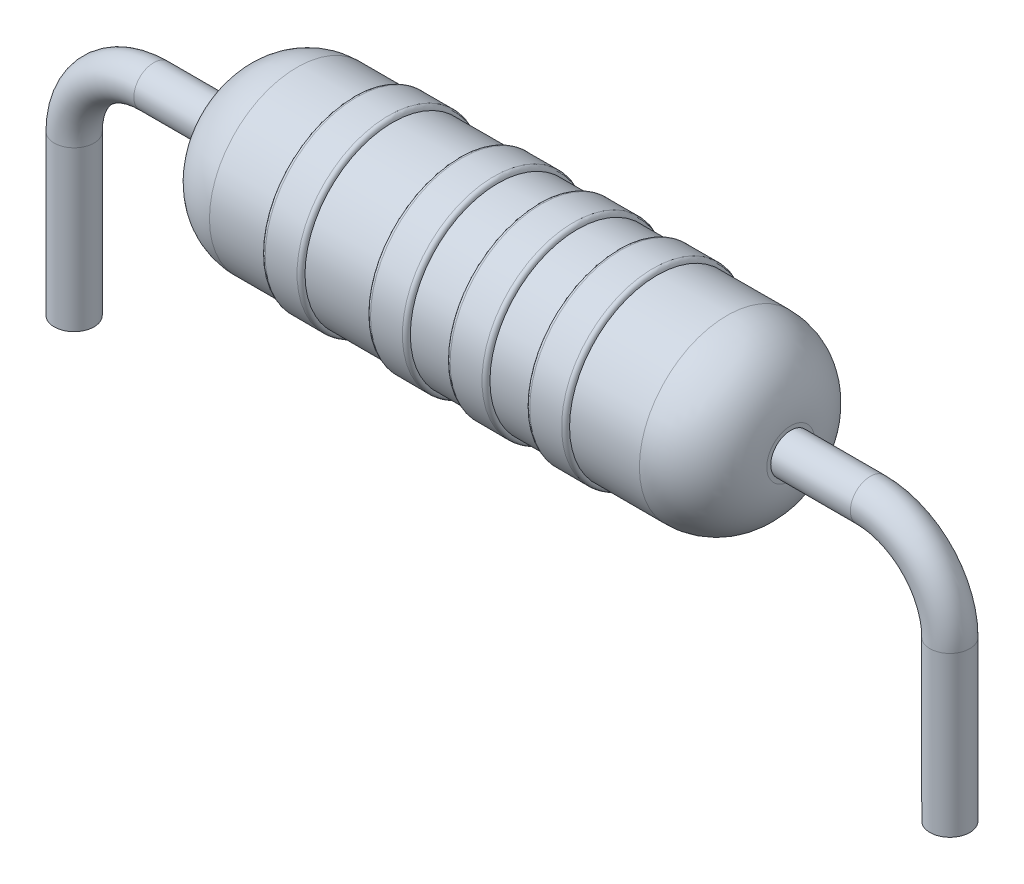
ISO-10303-21;
HEADER;
FILE_DESCRIPTION(('STEP AP214'),'2;1');
FILE_NAME('part.step','',(''),(''),'','','');
FILE_SCHEMA(('AUTOMOTIVE_DESIGN { 1 0 10303 214 1 1 1 1 }'));
ENDSEC;
DATA;
#1=APPLICATION_CONTEXT('core data for automotive mechanical design processes');
#2=APPLICATION_PROTOCOL_DEFINITION('international standard','automotive_design',2000,#1);
#3=PRODUCT_CONTEXT('',#1,'mechanical');
#4=PRODUCT('Part','Part','',(#3));
#5=PRODUCT_RELATED_PRODUCT_CATEGORY('part','',(#4));
#6=PRODUCT_DEFINITION_FORMATION('','',#4);
#7=PRODUCT_DEFINITION_CONTEXT('part definition',#1,'design');
#8=PRODUCT_DEFINITION('design','',#6,#7);
#9=PRODUCT_DEFINITION_SHAPE('','',#8);
#10=(LENGTH_UNIT() NAMED_UNIT(*) SI_UNIT(.MILLI.,.METRE.));
#11=(NAMED_UNIT(*) PLANE_ANGLE_UNIT() SI_UNIT($,.RADIAN.));
#12=(NAMED_UNIT(*) SI_UNIT($,.STERADIAN.) SOLID_ANGLE_UNIT());
#13=UNCERTAINTY_MEASURE_WITH_UNIT(LENGTH_MEASURE(1.E-05),#10,'distance_accuracy_value','');
#14=(GEOMETRIC_REPRESENTATION_CONTEXT(3) GLOBAL_UNCERTAINTY_ASSIGNED_CONTEXT((#13)) GLOBAL_UNIT_ASSIGNED_CONTEXT((#10,
#11,#12)) REPRESENTATION_CONTEXT('',''));
#15=CARTESIAN_POINT('',(0.,0.,0.));
#16=DIRECTION('',(0.,0.,1.));
#17=DIRECTION('',(1.,0.,0.));
#18=AXIS2_PLACEMENT_3D('',#15,#16,#17);
#19=CARTESIAN_POINT('',(-3.5,0.,0.));
#20=DIRECTION('',(1.,0.,0.));
#21=DIRECTION('',(0.,0.,-1.));
#22=AXIS2_PLACEMENT_3D('',#19,#20,#21);
#23=PLANE('',#22);
#24=CARTESIAN_POINT('',(-3.5,0.,0.));
#25=DIRECTION('',(-1.,0.,0.));
#26=DIRECTION('',(0.,0.,1.));
#27=AXIS2_PLACEMENT_3D('',#24,#25,#26);
#28=CIRCLE('',#27,0.299999999999995);
#29=CARTESIAN_POINT('',(-3.5,0.,0.299999999999995));
#30=VERTEX_POINT('',#29);
#31=EDGE_CURVE('E53',#30,#30,#28,.T.);
#32=ORIENTED_EDGE('',*,*,#31,.T.);
#33=EDGE_LOOP('',(#32));
#34=FACE_BOUND('',#33,.T.);
#35=CARTESIAN_POINT('',(-3.5,0.,0.));
#36=DIRECTION('',(-1.,0.,0.));
#37=DIRECTION('',(0.,0.,1.));
#38=AXIS2_PLACEMENT_3D('',#35,#36,#37);
#39=CIRCLE('',#38,0.25);
#40=CARTESIAN_POINT('',(-3.5,0.,0.25));
#41=VERTEX_POINT('',#40);
#42=EDGE_CURVE('E10',#41,#41,#39,.T.);
#43=ORIENTED_EDGE('',*,*,#42,.F.);
#44=EDGE_LOOP('',(#43));
#45=FACE_BOUND('',#44,.T.);
#46=ADVANCED_FACE('F26',(#34,#45),#23,.F.);
#47=CARTESIAN_POINT('',(-54.2686615886834,0.,0.));
#48=DIRECTION('',(-1.,0.,0.));
#49=DIRECTION('',(0.,0.,1.));
#50=AXIS2_PLACEMENT_3D('',#47,#48,#49);
#51=CYLINDRICAL_SURFACE('',#50,1.1);
#52=CARTESIAN_POINT('',(0.322975145638588,0.,0.));
#53=DIRECTION('',(-1.,0.,0.));
#54=DIRECTION('',(0.,0.,1.));
#55=AXIS2_PLACEMENT_3D('',#52,#53,#54);
#56=CIRCLE('',#55,1.1);
#57=CARTESIAN_POINT('',(0.322975145638588,0.,1.1));
#58=VERTEX_POINT('',#57);
#59=EDGE_CURVE('E73',#58,#58,#56,.T.);
#60=ORIENTED_EDGE('',*,*,#59,.T.);
#61=EDGE_LOOP('',(#60));
#62=FACE_BOUND('',#61,.T.);
#63=CARTESIAN_POINT('',(-0.177024854361413,0.,0.));
#64=DIRECTION('',(1.,0.,0.));
#65=DIRECTION('',(0.,0.,-1.));
#66=AXIS2_PLACEMENT_3D('',#63,#64,#65);
#67=CIRCLE('',#66,1.1);
#68=CARTESIAN_POINT('',(-0.177024854361413,0.,-1.1));
#69=VERTEX_POINT('',#68);
#70=EDGE_CURVE('E57',#69,#69,#67,.T.);
#71=ORIENTED_EDGE('',*,*,#70,.T.);
#72=EDGE_LOOP('',(#71));
#73=FACE_BOUND('',#72,.T.);
#74=ADVANCED_FACE('F143',(#62,#73),#51,.T.);
#75=CARTESIAN_POINT('',(4.3261723446646,0.,0.));
#76=DIRECTION('',(1.,0.,0.));
#77=DIRECTION('',(0.,0.,-1.));
#78=AXIS2_PLACEMENT_3D('',#75,#76,#77);
#79=CYLINDRICAL_SURFACE('',#78,1.15);
#80=CARTESIAN_POINT('',(-0.627024854361413,0.,0.));
#81=DIRECTION('',(-1.,0.,0.));
#82=DIRECTION('',(0.,0.,1.));
#83=AXIS2_PLACEMENT_3D('',#80,#81,#82);
#84=CIRCLE('',#83,1.15);
#85=CARTESIAN_POINT('',(-0.627024854361413,0.,1.15));
#86=VERTEX_POINT('',#85);
#87=EDGE_CURVE('E97',#86,#86,#84,.F.);
#88=ORIENTED_EDGE('',*,*,#87,.T.);
#89=EDGE_LOOP('',(#88));
#90=FACE_BOUND('',#89,.T.);
#91=CARTESIAN_POINT('',(-0.227024854361413,0.,0.));
#92=DIRECTION('',(1.,0.,0.));
#93=DIRECTION('',(0.,0.,-1.));
#94=AXIS2_PLACEMENT_3D('',#91,#92,#93);
#95=CIRCLE('',#94,1.15);
#96=CARTESIAN_POINT('',(-0.227024854361413,0.,-1.15));
#97=VERTEX_POINT('',#96);
#98=EDGE_CURVE('E94',#97,#97,#95,.F.);
#99=ORIENTED_EDGE('',*,*,#98,.T.);
#100=EDGE_LOOP('',(#99));
#101=FACE_BOUND('',#100,.T.);
#102=ADVANCED_FACE('F150',(#90,#101),#79,.T.);
#103=CARTESIAN_POINT('',(-1.5,0.,0.));
#104=DIRECTION('',(1.,0.,0.));
#105=DIRECTION('',(0.,0.,-1.));
#106=AXIS2_PLACEMENT_3D('',#103,#104,#105);
#107=CIRCLE('',#106,1.1);
#108=CARTESIAN_POINT('',(-1.5,0.,-1.1));
#109=VERTEX_POINT('',#108);
#110=EDGE_CURVE('E52',#109,#109,#107,.T.);
#111=ORIENTED_EDGE('',*,*,#110,.T.);
#112=EDGE_LOOP('',(#111));
#113=FACE_BOUND('',#112,.T.);
#114=CARTESIAN_POINT('',(-0.677024854361413,0.,0.));
#115=DIRECTION('',(-1.,0.,0.));
#116=DIRECTION('',(0.,0.,1.));
#117=AXIS2_PLACEMENT_3D('',#114,#115,#116);
#118=CIRCLE('',#117,1.1);
#119=CARTESIAN_POINT('',(-0.677024854361413,0.,1.1));
#120=VERTEX_POINT('',#119);
#121=EDGE_CURVE('E67',#120,#120,#118,.T.);
#122=ORIENTED_EDGE('',*,*,#121,.T.);
#123=EDGE_LOOP('',(#122));
#124=FACE_BOUND('',#123,.T.);
#125=ADVANCED_FACE('F152',(#113,#124),#51,.T.);
#126=CARTESIAN_POINT('',(4.3261723446646,0.,0.));
#127=DIRECTION('',(1.,0.,0.));
#128=DIRECTION('',(0.,0.,-1.));
#129=AXIS2_PLACEMENT_3D('',#126,#127,#128);
#130=CYLINDRICAL_SURFACE('',#129,1.15);
#131=CARTESIAN_POINT('',(0.372975145638587,0.,0.));
#132=DIRECTION('',(-1.,0.,0.));
#133=DIRECTION('',(0.,0.,1.));
#134=AXIS2_PLACEMENT_3D('',#131,#132,#133);
#135=CIRCLE('',#134,1.15);
#136=CARTESIAN_POINT('',(0.372975145638587,0.,1.15));
#137=VERTEX_POINT('',#136);
#138=EDGE_CURVE('E103',#137,#137,#135,.F.);
#139=ORIENTED_EDGE('',*,*,#138,.T.);
#140=EDGE_LOOP('',(#139));
#141=FACE_BOUND('',#140,.T.);
#142=CARTESIAN_POINT('',(0.772975145638587,0.,0.));
#143=DIRECTION('',(1.,0.,0.));
#144=DIRECTION('',(0.,0.,-1.));
#145=AXIS2_PLACEMENT_3D('',#142,#143,#144);
#146=CIRCLE('',#145,1.15);
#147=CARTESIAN_POINT('',(0.772975145638587,0.,-1.15));
#148=VERTEX_POINT('',#147);
#149=EDGE_CURVE('E100',#148,#148,#146,.F.);
#150=ORIENTED_EDGE('',*,*,#149,.T.);
#151=EDGE_LOOP('',(#150));
#152=FACE_BOUND('',#151,.T.);
#153=ADVANCED_FACE('F161',(#141,#152),#130,.T.);
#154=CARTESIAN_POINT('',(1.32297514563859,0.,0.));
#155=DIRECTION('',(-1.,0.,0.));
#156=DIRECTION('',(0.,0.,1.));
#157=AXIS2_PLACEMENT_3D('',#154,#155,#156);
#158=CIRCLE('',#157,1.1);
#159=CARTESIAN_POINT('',(1.32297514563859,0.,1.1));
#160=VERTEX_POINT('',#159);
#161=EDGE_CURVE('E79',#160,#160,#158,.T.);
#162=ORIENTED_EDGE('',*,*,#161,.T.);
#163=EDGE_LOOP('',(#162));
#164=FACE_BOUND('',#163,.T.);
#165=CARTESIAN_POINT('',(0.822975145638588,0.,0.));
#166=DIRECTION('',(1.,0.,0.));
#167=DIRECTION('',(0.,0.,-1.));
#168=AXIS2_PLACEMENT_3D('',#165,#166,#167);
#169=CIRCLE('',#168,1.1);
#170=CARTESIAN_POINT('',(0.822975145638588,0.,-1.1));
#171=VERTEX_POINT('',#170);
#172=EDGE_CURVE('E70',#171,#171,#169,.T.);
#173=ORIENTED_EDGE('',*,*,#172,.T.);
#174=EDGE_LOOP('',(#173));
#175=FACE_BOUND('',#174,.T.);
#176=ADVANCED_FACE('F124',(#164,#175),#51,.T.);
#177=CARTESIAN_POINT('',(4.3261723446646,0.,0.));
#178=DIRECTION('',(1.,0.,0.));
#179=DIRECTION('',(0.,0.,-1.));
#180=AXIS2_PLACEMENT_3D('',#177,#178,#179);
#181=CYLINDRICAL_SURFACE('',#180,1.15);
#182=CARTESIAN_POINT('',(1.37297514563859,0.,0.));
#183=DIRECTION('',(-1.,0.,0.));
#184=DIRECTION('',(0.,0.,1.));
#185=AXIS2_PLACEMENT_3D('',#182,#183,#184);
#186=CIRCLE('',#185,1.15);
#187=CARTESIAN_POINT('',(1.37297514563859,0.,1.15));
#188=VERTEX_POINT('',#187);
#189=EDGE_CURVE('E30',#188,#188,#186,.F.);
#190=ORIENTED_EDGE('',*,*,#189,.T.);
#191=EDGE_LOOP('',(#190));
#192=FACE_BOUND('',#191,.T.);
#193=CARTESIAN_POINT('',(1.77297514563859,0.,0.));
#194=DIRECTION('',(1.,0.,0.));
#195=DIRECTION('',(0.,0.,-1.));
#196=AXIS2_PLACEMENT_3D('',#193,#194,#195);
#197=CIRCLE('',#196,1.15);
#198=CARTESIAN_POINT('',(1.77297514563859,0.,-1.15));
#199=VERTEX_POINT('',#198);
#200=EDGE_CURVE('E38',#199,#199,#197,.F.);
#201=ORIENTED_EDGE('',*,*,#200,.T.);
#202=EDGE_LOOP('',(#201));
#203=FACE_BOUND('',#202,.T.);
#204=ADVANCED_FACE('F108',(#192,#203),#181,.T.);
#205=CARTESIAN_POINT('',(3.5,0.299999999999995,0.));
#206=DIRECTION('',(-1.,0.,0.));
#207=DIRECTION('',(0.,0.,1.));
#208=AXIS2_PLACEMENT_3D('',#205,#206,#207);
#209=PLANE('',#208);
#210=CARTESIAN_POINT('',(3.5,0.,0.));
#211=DIRECTION('',(-1.,0.,0.));
#212=DIRECTION('',(0.,0.,1.));
#213=AXIS2_PLACEMENT_3D('',#210,#211,#212);
#214=CIRCLE('',#213,0.25);
#215=CARTESIAN_POINT('',(3.5,0.,0.25));
#216=VERTEX_POINT('',#215);
#217=EDGE_CURVE('E256',#216,#216,#214,.T.);
#218=ORIENTED_EDGE('',*,*,#217,.T.);
#219=EDGE_LOOP('',(#218));
#220=FACE_BOUND('',#219,.T.);
#221=CARTESIAN_POINT('',(3.5,0.,0.));
#222=DIRECTION('',(-1.,0.,0.));
#223=DIRECTION('',(0.,0.,1.));
#224=AXIS2_PLACEMENT_3D('',#221,#222,#223);
#225=CIRCLE('',#224,0.299999999999995);
#226=CARTESIAN_POINT('',(3.5,0.,0.299999999999995));
#227=VERTEX_POINT('',#226);
#228=EDGE_CURVE('E63',#227,#227,#225,.T.);
#229=ORIENTED_EDGE('',*,*,#228,.F.);
#230=EDGE_LOOP('',(#229));
#231=FACE_BOUND('',#230,.T.);
#232=ADVANCED_FACE('F28',(#220,#231),#209,.F.);
#233=CARTESIAN_POINT('',(2.7,0.,0.));
#234=DIRECTION('',(-1.,0.,0.));
#235=DIRECTION('',(0.,0.,1.));
#236=AXIS2_PLACEMENT_3D('',#233,#234,#235);
#237=DEGENERATE_TOROIDAL_SURFACE('',#236,0.3,0.8,.T.);
#238=CARTESIAN_POINT('',(2.69999999999999,0.,0.));
#239=DIRECTION('',(-1.,0.,0.));
#240=DIRECTION('',(0.,0.,1.));
#241=AXIS2_PLACEMENT_3D('',#238,#239,#240);
#242=CIRCLE('',#241,1.1);
#243=CARTESIAN_POINT('',(2.69999999999999,0.,1.1));
#244=VERTEX_POINT('',#243);
#245=EDGE_CURVE('E60',#244,#244,#242,.T.);
#246=ORIENTED_EDGE('',*,*,#245,.F.);
#247=EDGE_LOOP('',(#246));
#248=FACE_BOUND('',#247,.T.);
#249=ORIENTED_EDGE('',*,*,#228,.T.);
#250=EDGE_LOOP('',(#249));
#251=FACE_BOUND('',#250,.T.);
#252=ADVANCED_FACE('F122',(#248,#251),#237,.T.);
#253=CARTESIAN_POINT('',(1.82297514563859,0.,0.));
#254=DIRECTION('',(1.,0.,0.));
#255=DIRECTION('',(0.,0.,-1.));
#256=AXIS2_PLACEMENT_3D('',#253,#254,#255);
#257=CIRCLE('',#256,1.1);
#258=CARTESIAN_POINT('',(1.82297514563859,0.,-1.1));
#259=VERTEX_POINT('',#258);
#260=EDGE_CURVE('E76',#259,#259,#257,.T.);
#261=ORIENTED_EDGE('',*,*,#260,.T.);
#262=EDGE_LOOP('',(#261));
#263=FACE_BOUND('',#262,.T.);
#264=ORIENTED_EDGE('',*,*,#245,.T.);
#265=EDGE_LOOP('',(#264));
#266=FACE_BOUND('',#265,.T.);
#267=ADVANCED_FACE('F118',(#263,#266),#51,.T.);
#268=CARTESIAN_POINT('',(4.3261723446646,0.,0.));
#269=DIRECTION('',(1.,0.,0.));
#270=DIRECTION('',(0.,0.,-1.));
#271=AXIS2_PLACEMENT_3D('',#268,#269,#270);
#272=CYLINDRICAL_SURFACE('',#271,1.15);
#273=CARTESIAN_POINT('',(-1.95,0.,0.));
#274=DIRECTION('',(-1.,0.,0.));
#275=DIRECTION('',(0.,0.,1.));
#276=AXIS2_PLACEMENT_3D('',#273,#274,#275);
#277=CIRCLE('',#276,1.15);
#278=CARTESIAN_POINT('',(-1.95,0.,1.15));
#279=VERTEX_POINT('',#278);
#280=EDGE_CURVE('E91',#279,#279,#277,.F.);
#281=ORIENTED_EDGE('',*,*,#280,.T.);
#282=EDGE_LOOP('',(#281));
#283=FACE_BOUND('',#282,.T.);
#284=CARTESIAN_POINT('',(-1.55,0.,0.));
#285=DIRECTION('',(1.,0.,0.));
#286=DIRECTION('',(0.,0.,-1.));
#287=AXIS2_PLACEMENT_3D('',#284,#285,#286);
#288=CIRCLE('',#287,1.15);
#289=CARTESIAN_POINT('',(-1.55,0.,-1.15));
#290=VERTEX_POINT('',#289);
#291=EDGE_CURVE('E66',#290,#290,#288,.F.);
#292=ORIENTED_EDGE('',*,*,#291,.T.);
#293=EDGE_LOOP('',(#292));
#294=FACE_BOUND('',#293,.T.);
#295=ADVANCED_FACE('F121',(#283,#294),#272,.T.);
#296=CARTESIAN_POINT('',(-2.7,0.,0.));
#297=DIRECTION('',(-1.,0.,0.));
#298=DIRECTION('',(0.,0.,1.));
#299=AXIS2_PLACEMENT_3D('',#296,#297,#298);
#300=DEGENERATE_TOROIDAL_SURFACE('',#299,0.3,0.8,.T.);
#301=ORIENTED_EDGE('',*,*,#31,.F.);
#302=EDGE_LOOP('',(#301));
#303=FACE_BOUND('',#302,.T.);
#304=CARTESIAN_POINT('',(-2.69999999999999,0.,0.));
#305=DIRECTION('',(-1.,0.,0.));
#306=DIRECTION('',(0.,0.,1.));
#307=AXIS2_PLACEMENT_3D('',#304,#305,#306);
#308=CIRCLE('',#307,1.1);
#309=CARTESIAN_POINT('',(-2.69999999999999,0.,1.1));
#310=VERTEX_POINT('',#309);
#311=EDGE_CURVE('E56',#310,#310,#308,.T.);
#312=ORIENTED_EDGE('',*,*,#311,.T.);
#313=EDGE_LOOP('',(#312));
#314=FACE_BOUND('',#313,.T.);
#315=ADVANCED_FACE('F157',(#303,#314),#300,.T.);
#316=CARTESIAN_POINT('',(-2.,0.,0.));
#317=DIRECTION('',(-1.,0.,0.));
#318=DIRECTION('',(0.,0.,1.));
#319=AXIS2_PLACEMENT_3D('',#316,#317,#318);
#320=CIRCLE('',#319,1.1);
#321=CARTESIAN_POINT('',(-2.,0.,1.1));
#322=VERTEX_POINT('',#321);
#323=EDGE_CURVE('E82',#322,#322,#320,.T.);
#324=ORIENTED_EDGE('',*,*,#323,.T.);
#325=EDGE_LOOP('',(#324));
#326=FACE_BOUND('',#325,.T.);
#327=ORIENTED_EDGE('',*,*,#311,.F.);
#328=EDGE_LOOP('',(#327));
#329=FACE_BOUND('',#328,.T.);
#330=ADVANCED_FACE('F125',(#326,#329),#51,.T.);
#331=CARTESIAN_POINT('',(-1.95,0.,0.));
#332=DIRECTION('',(-1.,0.,0.));
#333=DIRECTION('',(0.,0.,1.));
#334=AXIS2_PLACEMENT_3D('',#331,#332,#333);
#335=TOROIDAL_SURFACE('',#334,1.1,0.05);
#336=ORIENTED_EDGE('',*,*,#323,.F.);
#337=EDGE_LOOP('',(#336));
#338=FACE_BOUND('',#337,.T.);
#339=ORIENTED_EDGE('',*,*,#280,.F.);
#340=EDGE_LOOP('',(#339));
#341=FACE_BOUND('',#340,.T.);
#342=ADVANCED_FACE('F172',(#338,#341),#335,.T.);
#343=CARTESIAN_POINT('',(-1.55,0.,0.));
#344=DIRECTION('',(1.,0.,0.));
#345=DIRECTION('',(0.,0.,-1.));
#346=AXIS2_PLACEMENT_3D('',#343,#344,#345);
#347=TOROIDAL_SURFACE('',#346,1.1,0.05);
#348=ORIENTED_EDGE('',*,*,#291,.F.);
#349=EDGE_LOOP('',(#348));
#350=FACE_BOUND('',#349,.T.);
#351=ORIENTED_EDGE('',*,*,#110,.F.);
#352=EDGE_LOOP('',(#351));
#353=FACE_BOUND('',#352,.T.);
#354=ADVANCED_FACE('F177',(#350,#353),#347,.T.);
#355=CARTESIAN_POINT('',(-0.627024854361413,0.,0.));
#356=DIRECTION('',(-1.,0.,0.));
#357=DIRECTION('',(0.,0.,1.));
#358=AXIS2_PLACEMENT_3D('',#355,#356,#357);
#359=TOROIDAL_SURFACE('',#358,1.1,0.05);
#360=ORIENTED_EDGE('',*,*,#121,.F.);
#361=EDGE_LOOP('',(#360));
#362=FACE_BOUND('',#361,.T.);
#363=ORIENTED_EDGE('',*,*,#87,.F.);
#364=EDGE_LOOP('',(#363));
#365=FACE_BOUND('',#364,.T.);
#366=ADVANCED_FACE('F194',(#362,#365),#359,.T.);
#367=CARTESIAN_POINT('',(-0.227024854361413,0.,0.));
#368=DIRECTION('',(1.,0.,0.));
#369=DIRECTION('',(0.,0.,-1.));
#370=AXIS2_PLACEMENT_3D('',#367,#368,#369);
#371=TOROIDAL_SURFACE('',#370,1.1,0.05);
#372=ORIENTED_EDGE('',*,*,#98,.F.);
#373=EDGE_LOOP('',(#372));
#374=FACE_BOUND('',#373,.T.);
#375=ORIENTED_EDGE('',*,*,#70,.F.);
#376=EDGE_LOOP('',(#375));
#377=FACE_BOUND('',#376,.T.);
#378=ADVANCED_FACE('F200',(#374,#377),#371,.T.);
#379=CARTESIAN_POINT('',(0.372975145638587,0.,0.));
#380=DIRECTION('',(-1.,0.,0.));
#381=DIRECTION('',(0.,0.,1.));
#382=AXIS2_PLACEMENT_3D('',#379,#380,#381);
#383=TOROIDAL_SURFACE('',#382,1.1,0.05);
#384=ORIENTED_EDGE('',*,*,#59,.F.);
#385=EDGE_LOOP('',(#384));
#386=FACE_BOUND('',#385,.T.);
#387=ORIENTED_EDGE('',*,*,#138,.F.);
#388=EDGE_LOOP('',(#387));
#389=FACE_BOUND('',#388,.T.);
#390=ADVANCED_FACE('F206',(#386,#389),#383,.T.);
#391=CARTESIAN_POINT('',(0.772975145638587,0.,0.));
#392=DIRECTION('',(1.,0.,0.));
#393=DIRECTION('',(0.,0.,-1.));
#394=AXIS2_PLACEMENT_3D('',#391,#392,#393);
#395=TOROIDAL_SURFACE('',#394,1.1,0.05);
#396=ORIENTED_EDGE('',*,*,#149,.F.);
#397=EDGE_LOOP('',(#396));
#398=FACE_BOUND('',#397,.T.);
#399=ORIENTED_EDGE('',*,*,#172,.F.);
#400=EDGE_LOOP('',(#399));
#401=FACE_BOUND('',#400,.T.);
#402=ADVANCED_FACE('F210',(#398,#401),#395,.T.);
#403=CARTESIAN_POINT('',(1.37297514563859,0.,0.));
#404=DIRECTION('',(-1.,0.,0.));
#405=DIRECTION('',(0.,0.,1.));
#406=AXIS2_PLACEMENT_3D('',#403,#404,#405);
#407=TOROIDAL_SURFACE('',#406,1.1,0.05);
#408=ORIENTED_EDGE('',*,*,#161,.F.);
#409=EDGE_LOOP('',(#408));
#410=FACE_BOUND('',#409,.T.);
#411=ORIENTED_EDGE('',*,*,#189,.F.);
#412=EDGE_LOOP('',(#411));
#413=FACE_BOUND('',#412,.T.);
#414=ADVANCED_FACE('F114',(#410,#413),#407,.T.);
#415=CARTESIAN_POINT('',(1.77297514563859,0.,0.));
#416=DIRECTION('',(1.,0.,0.));
#417=DIRECTION('',(0.,0.,-1.));
#418=AXIS2_PLACEMENT_3D('',#415,#416,#417);
#419=TOROIDAL_SURFACE('',#418,1.1,0.05);
#420=ORIENTED_EDGE('',*,*,#200,.F.);
#421=EDGE_LOOP('',(#420));
#422=FACE_BOUND('',#421,.T.);
#423=ORIENTED_EDGE('',*,*,#260,.F.);
#424=EDGE_LOOP('',(#423));
#425=FACE_BOUND('',#424,.T.);
#426=ADVANCED_FACE('F110',(#422,#425),#419,.T.);
#427=CARTESIAN_POINT('',(-5.5,-1.00000000000001,0.));
#428=DIRECTION('',(0.,-1.,0.));
#429=DIRECTION('',(0.,0.,-1.));
#430=AXIS2_PLACEMENT_3D('',#427,#428,#429);
#431=CYLINDRICAL_SURFACE('',#430,0.25);
#432=CARTESIAN_POINT('',(-5.5,-1.00000000000001,0.));
#433=DIRECTION('',(0.,-1.,0.));
#434=DIRECTION('',(0.,0.,1.));
#435=AXIS2_PLACEMENT_3D('',#432,#433,#434);
#436=CIRCLE('',#435,0.25);
#437=CARTESIAN_POINT('',(-5.75,-1.00000000000001,0.));
#438=VERTEX_POINT('',#437);
#439=EDGE_CURVE('E46',#438,#438,#436,.T.);
#440=ORIENTED_EDGE('',*,*,#439,.T.);
#441=EDGE_LOOP('',(#440));
#442=FACE_BOUND('',#441,.T.);
#443=CARTESIAN_POINT('',(-5.5,-3.,0.));
#444=DIRECTION('',(0.,-1.,0.));
#445=DIRECTION('',(0.,0.,1.));
#446=AXIS2_PLACEMENT_3D('',#443,#444,#445);
#447=CIRCLE('',#446,0.25);
#448=CARTESIAN_POINT('',(-5.5,-3.,0.25));
#449=VERTEX_POINT('',#448);
#450=EDGE_CURVE('E49',#449,#449,#447,.T.);
#451=ORIENTED_EDGE('',*,*,#450,.F.);
#452=EDGE_LOOP('',(#451));
#453=FACE_BOUND('',#452,.T.);
#454=ADVANCED_FACE('F113',(#442,#453),#431,.T.);
#455=CARTESIAN_POINT('',(-4.5,-1.,0.));
#456=DIRECTION('',(0.,0.,1.));
#457=DIRECTION('',(1.,0.,0.));
#458=AXIS2_PLACEMENT_3D('',#455,#456,#457);
#459=TOROIDAL_SURFACE('',#458,1.,0.25);
#460=CARTESIAN_POINT('',(-4.49999999999999,0.,0.));
#461=DIRECTION('',(-1.,0.,0.));
#462=DIRECTION('',(0.,0.,1.));
#463=AXIS2_PLACEMENT_3D('',#460,#461,#462);
#464=CIRCLE('',#463,0.25);
#465=CARTESIAN_POINT('',(-4.49999999999999,0.25,0.));
#466=VERTEX_POINT('',#465);
#467=EDGE_CURVE('E43',#466,#466,#464,.T.);
#468=CARTESIAN_POINT('',(-4.5,-1.,0.));
#469=DIRECTION('',(0.,0.,1.));
#470=DIRECTION('',(1.,0.,0.));
#471=AXIS2_PLACEMENT_3D('',#468,#469,#470);
#472=CIRCLE('',#471,1.25);
#473=EDGE_CURVE('',#466,#438,#472,.T.);
#474=ORIENTED_EDGE('',*,*,#467,.T.);
#475=ORIENTED_EDGE('',*,*,#439,.F.);
#476=ORIENTED_EDGE('',*,*,#473,.T.);
#477=ORIENTED_EDGE('',*,*,#473,.F.);
#478=EDGE_LOOP('',(#474,#476,#475,#477));
#479=FACE_BOUND('',#478,.T.);
#480=ADVANCED_FACE('F219',(#479),#459,.T.);
#481=CARTESIAN_POINT('',(-4.49999999999999,0.,0.));
#482=DIRECTION('',(1.,0.,0.));
#483=DIRECTION('',(0.,0.,-1.));
#484=AXIS2_PLACEMENT_3D('',#481,#482,#483);
#485=CYLINDRICAL_SURFACE('',#484,0.25);
#486=ORIENTED_EDGE('',*,*,#467,.F.);
#487=EDGE_LOOP('',(#486));
#488=FACE_BOUND('',#487,.T.);
#489=ORIENTED_EDGE('',*,*,#42,.T.);
#490=EDGE_LOOP('',(#489));
#491=FACE_BOUND('',#490,.T.);
#492=ADVANCED_FACE('F223',(#488,#491),#485,.T.);
#493=CARTESIAN_POINT('',(-5.5,-3.,0.));
#494=DIRECTION('',(0.,-1.,0.));
#495=DIRECTION('',(0.,0.,1.));
#496=AXIS2_PLACEMENT_3D('',#493,#494,#495);
#497=PLANE('',#496);
#498=ORIENTED_EDGE('',*,*,#450,.T.);
#499=EDGE_LOOP('',(#498));
#500=FACE_BOUND('',#499,.T.);
#501=ADVANCED_FACE('F227',(#500),#497,.T.);
#502=CARTESIAN_POINT('',(5.5,-1.00000000000001,0.));
#503=DIRECTION('',(0.,-1.,0.));
#504=DIRECTION('',(0.,0.,-1.));
#505=AXIS2_PLACEMENT_3D('',#502,#503,#504);
#506=CYLINDRICAL_SURFACE('',#505,0.25);
#507=CARTESIAN_POINT('',(5.5,-1.00000000000001,0.));
#508=DIRECTION('',(0.,1.,0.));
#509=DIRECTION('',(0.,0.,1.));
#510=AXIS2_PLACEMENT_3D('',#507,#508,#509);
#511=CIRCLE('',#510,0.25);
#512=CARTESIAN_POINT('',(5.75,-1.00000000000001,0.));
#513=VERTEX_POINT('',#512);
#514=EDGE_CURVE('E250',#513,#513,#511,.T.);
#515=ORIENTED_EDGE('',*,*,#514,.F.);
#516=EDGE_LOOP('',(#515));
#517=FACE_BOUND('',#516,.T.);
#518=CARTESIAN_POINT('',(5.5,-3.,0.));
#519=DIRECTION('',(0.,1.,0.));
#520=DIRECTION('',(0.,0.,1.));
#521=AXIS2_PLACEMENT_3D('',#518,#519,#520);
#522=CIRCLE('',#521,0.25);
#523=CARTESIAN_POINT('',(5.5,-3.,0.25));
#524=VERTEX_POINT('',#523);
#525=EDGE_CURVE('E41',#524,#524,#522,.T.);
#526=ORIENTED_EDGE('',*,*,#525,.T.);
#527=EDGE_LOOP('',(#526));
#528=FACE_BOUND('',#527,.T.);
#529=ADVANCED_FACE('F230',(#517,#528),#506,.T.);
#530=CARTESIAN_POINT('',(4.5,-1.,0.));
#531=DIRECTION('',(0.,0.,-1.));
#532=DIRECTION('',(-1.,0.,0.));
#533=AXIS2_PLACEMENT_3D('',#530,#531,#532);
#534=TOROIDAL_SURFACE('',#533,1.,0.25);
#535=CARTESIAN_POINT('',(4.49999999999999,0.,0.));
#536=DIRECTION('',(-1.,0.,0.));
#537=DIRECTION('',(0.,0.,1.));
#538=AXIS2_PLACEMENT_3D('',#535,#536,#537);
#539=CIRCLE('',#538,0.25);
#540=CARTESIAN_POINT('',(4.49999999999999,0.25,0.));
#541=VERTEX_POINT('',#540);
#542=EDGE_CURVE('E252',#541,#541,#539,.T.);
#543=CARTESIAN_POINT('',(4.5,-1.,0.));
#544=DIRECTION('',(0.,0.,-1.));
#545=DIRECTION('',(-1.,0.,0.));
#546=AXIS2_PLACEMENT_3D('',#543,#544,#545);
#547=CIRCLE('',#546,1.25);
#548=EDGE_CURVE('',#541,#513,#547,.T.);
#549=ORIENTED_EDGE('',*,*,#542,.F.);
#550=ORIENTED_EDGE('',*,*,#514,.T.);
#551=ORIENTED_EDGE('',*,*,#548,.T.);
#552=ORIENTED_EDGE('',*,*,#548,.F.);
#553=EDGE_LOOP('',(#549,#551,#550,#552));
#554=FACE_BOUND('',#553,.T.);
#555=ADVANCED_FACE('F233',(#554),#534,.T.);
#556=CARTESIAN_POINT('',(4.49999999999999,0.,0.));
#557=DIRECTION('',(-1.,0.,0.));
#558=DIRECTION('',(0.,0.,1.));
#559=AXIS2_PLACEMENT_3D('',#556,#557,#558);
#560=CYLINDRICAL_SURFACE('',#559,0.25);
#561=ORIENTED_EDGE('',*,*,#542,.T.);
#562=EDGE_LOOP('',(#561));
#563=FACE_BOUND('',#562,.T.);
#564=ORIENTED_EDGE('',*,*,#217,.F.);
#565=EDGE_LOOP('',(#564));
#566=FACE_BOUND('',#565,.T.);
#567=ADVANCED_FACE('F237',(#563,#566),#560,.T.);
#568=CARTESIAN_POINT('',(5.5,-3.,0.));
#569=DIRECTION('',(0.,-1.,0.));
#570=DIRECTION('',(0.,0.,1.));
#571=AXIS2_PLACEMENT_3D('',#568,#569,#570);
#572=PLANE('',#571);
#573=ORIENTED_EDGE('',*,*,#525,.F.);
#574=EDGE_LOOP('',(#573));
#575=FACE_BOUND('',#574,.T.);
#576=ADVANCED_FACE('F241',(#575),#572,.T.);
#577=CLOSED_SHELL('',(#46,#74,#102,#125,#153,#176,#204,#232,#252,#267,#295,#315,#330,#342,#354,
#366,#378,#390,#402,#414,#426,#454,#480,#492,#501,#529,#555,#567,#576));
#578=MANIFOLD_SOLID_BREP('B2',#577);
#579=ADVANCED_BREP_SHAPE_REPRESENTATION('',(#18,#578),#14);
#580=SHAPE_DEFINITION_REPRESENTATION(#9,#579);
ENDSEC;
END-ISO-10303-21;
